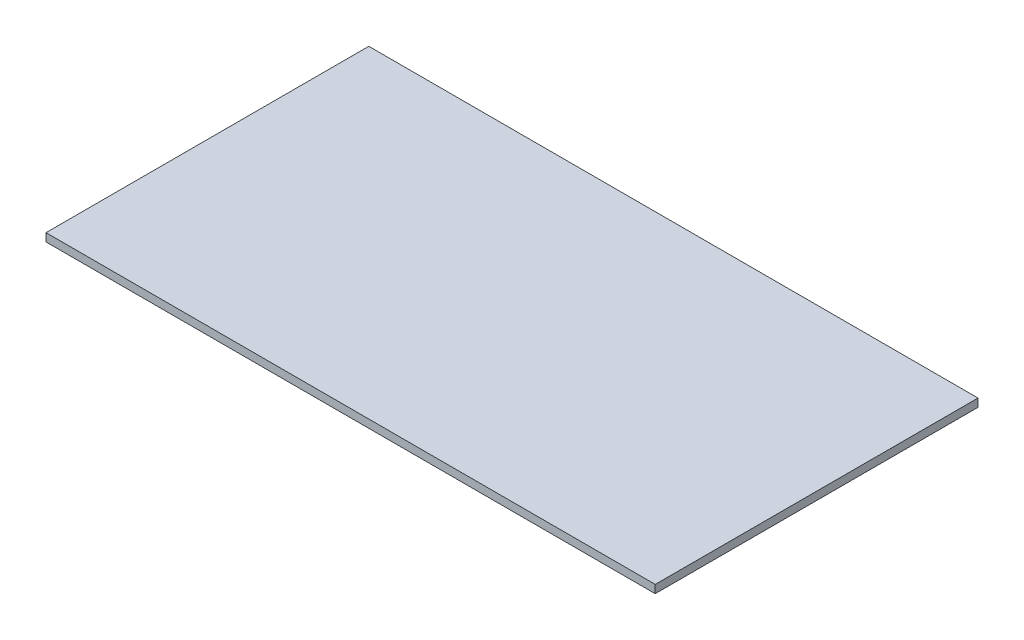
ISO-10303-21;
HEADER;
FILE_DESCRIPTION(('STEP AP214'),'2;1');
FILE_NAME('part.step','',(''),(''),'','','');
FILE_SCHEMA(('AUTOMOTIVE_DESIGN { 1 0 10303 214 1 1 1 1 }'));
ENDSEC;
DATA;
#1=APPLICATION_CONTEXT('core data for automotive mechanical design processes');
#2=APPLICATION_PROTOCOL_DEFINITION('international standard','automotive_design',2000,#1);
#3=PRODUCT_CONTEXT('',#1,'mechanical');
#4=PRODUCT('Part','Part','',(#3));
#5=PRODUCT_RELATED_PRODUCT_CATEGORY('part','',(#4));
#6=PRODUCT_DEFINITION_FORMATION('','',#4);
#7=PRODUCT_DEFINITION_CONTEXT('part definition',#1,'design');
#8=PRODUCT_DEFINITION('design','',#6,#7);
#9=PRODUCT_DEFINITION_SHAPE('','',#8);
#10=(LENGTH_UNIT() NAMED_UNIT(*) SI_UNIT(.MILLI.,.METRE.));
#11=(NAMED_UNIT(*) PLANE_ANGLE_UNIT() SI_UNIT($,.RADIAN.));
#12=(NAMED_UNIT(*) SI_UNIT($,.STERADIAN.) SOLID_ANGLE_UNIT());
#13=UNCERTAINTY_MEASURE_WITH_UNIT(LENGTH_MEASURE(1.E-05),#10,'distance_accuracy_value','');
#14=(GEOMETRIC_REPRESENTATION_CONTEXT(3) GLOBAL_UNCERTAINTY_ASSIGNED_CONTEXT((#13)) GLOBAL_UNIT_ASSIGNED_CONTEXT((#10,
#11,#12)) REPRESENTATION_CONTEXT('',''));
#15=CARTESIAN_POINT('',(0.,0.,0.));
#16=DIRECTION('',(0.,0.,1.));
#17=DIRECTION('',(1.,0.,0.));
#18=AXIS2_PLACEMENT_3D('',#15,#16,#17);
#19=CARTESIAN_POINT('',(0.,0.,80.));
#20=DIRECTION('',(0.,1.,0.));
#21=DIRECTION('',(0.,0.,1.));
#22=AXIS2_PLACEMENT_3D('',#19,#20,#21);
#23=PLANE('',#22);
#24=DIRECTION('',(1.,0.,0.));
#25=VECTOR('',#24,1.);
#26=CARTESIAN_POINT('',(0.,0.,80.));
#27=LINE('',#26,#25);
#28=CARTESIAN_POINT('',(2.,0.,80.));
#29=VERTEX_POINT('',#28);
#30=CARTESIAN_POINT('',(153.,0.,80.));
#31=VERTEX_POINT('',#30);
#32=EDGE_CURVE('E12',#29,#31,#27,.T.);
#33=ORIENTED_EDGE('',*,*,#32,.F.);
#34=DIRECTION('',(0.,0.,1.));
#35=VECTOR('',#34,1.);
#36=CARTESIAN_POINT('',(2.,0.,0.));
#37=LINE('',#36,#35);
#38=CARTESIAN_POINT('',(2.,0.,0.));
#39=VERTEX_POINT('',#38);
#40=EDGE_CURVE('E127',#39,#29,#37,.T.);
#41=ORIENTED_EDGE('',*,*,#40,.F.);
#42=DIRECTION('',(1.,0.,0.));
#43=VECTOR('',#42,1.);
#44=CARTESIAN_POINT('',(0.,0.,0.));
#45=LINE('',#44,#43);
#46=CARTESIAN_POINT('',(153.,0.,0.));
#47=VERTEX_POINT('',#46);
#48=EDGE_CURVE('E65',#39,#47,#45,.T.);
#49=ORIENTED_EDGE('',*,*,#48,.T.);
#50=DIRECTION('',(0.,0.,1.));
#51=VECTOR('',#50,1.);
#52=CARTESIAN_POINT('',(153.,0.,0.));
#53=LINE('',#52,#51);
#54=EDGE_CURVE('E99',#47,#31,#53,.T.);
#55=ORIENTED_EDGE('',*,*,#54,.T.);
#56=EDGE_LOOP('',(#33,#41,#49,#55));
#57=FACE_BOUND('',#56,.T.);
#58=ADVANCED_FACE('F62',(#57),#23,.F.);
#59=CARTESIAN_POINT('',(153.,2.,2.));
#60=DIRECTION('',(0.,1.,0.));
#61=DIRECTION('',(0.,0.,1.));
#62=AXIS2_PLACEMENT_3D('',#59,#60,#61);
#63=PLANE('',#62);
#64=DIRECTION('',(-1.,0.,0.));
#65=VECTOR('',#64,1.);
#66=CARTESIAN_POINT('',(153.,2.,80.));
#67=LINE('',#66,#65);
#68=CARTESIAN_POINT('',(153.,2.,80.));
#69=VERTEX_POINT('',#68);
#70=CARTESIAN_POINT('',(2.,2.,80.));
#71=VERTEX_POINT('',#70);
#72=EDGE_CURVE('E119',#69,#71,#67,.T.);
#73=ORIENTED_EDGE('',*,*,#72,.F.);
#74=DIRECTION('',(0.,0.,1.));
#75=VECTOR('',#74,1.);
#76=CARTESIAN_POINT('',(153.,2.,2.));
#77=LINE('',#76,#75);
#78=CARTESIAN_POINT('',(153.,2.,0.));
#79=VERTEX_POINT('',#78);
#80=EDGE_CURVE('E79',#79,#69,#77,.T.);
#81=ORIENTED_EDGE('',*,*,#80,.F.);
#82=DIRECTION('',(-1.,0.,0.));
#83=VECTOR('',#82,1.);
#84=CARTESIAN_POINT('',(0.,2.,0.));
#85=LINE('',#84,#83);
#86=CARTESIAN_POINT('',(2.,2.,0.));
#87=VERTEX_POINT('',#86);
#88=EDGE_CURVE('E133',#79,#87,#85,.T.);
#89=ORIENTED_EDGE('',*,*,#88,.T.);
#90=DIRECTION('',(0.,0.,1.));
#91=VECTOR('',#90,1.);
#92=CARTESIAN_POINT('',(2.,2.,2.));
#93=LINE('',#92,#91);
#94=EDGE_CURVE('E138',#87,#71,#93,.T.);
#95=ORIENTED_EDGE('',*,*,#94,.T.);
#96=EDGE_LOOP('',(#73,#81,#89,#95));
#97=FACE_BOUND('',#96,.T.);
#98=ADVANCED_FACE('F142',(#97),#63,.T.);
#99=CARTESIAN_POINT('',(0.,0.,80.));
#100=DIRECTION('',(0.,0.,1.));
#101=DIRECTION('',(1.,0.,0.));
#102=AXIS2_PLACEMENT_3D('',#99,#100,#101);
#103=PLANE('',#102);
#104=DIRECTION('',(0.,1.,0.));
#105=VECTOR('',#104,1.);
#106=CARTESIAN_POINT('',(2.,0.,80.));
#107=LINE('',#106,#105);
#108=EDGE_CURVE('E115',#29,#71,#107,.T.);
#109=ORIENTED_EDGE('',*,*,#108,.F.);
#110=ORIENTED_EDGE('',*,*,#32,.T.);
#111=DIRECTION('',(0.,1.,0.));
#112=VECTOR('',#111,1.);
#113=CARTESIAN_POINT('',(153.,0.,80.));
#114=LINE('',#113,#112);
#115=EDGE_CURVE('E102',#31,#69,#114,.T.);
#116=ORIENTED_EDGE('',*,*,#115,.T.);
#117=ORIENTED_EDGE('',*,*,#72,.T.);
#118=EDGE_LOOP('',(#109,#110,#116,#117));
#119=FACE_BOUND('',#118,.T.);
#120=ADVANCED_FACE('F118',(#119),#103,.T.);
#121=CARTESIAN_POINT('',(0.,0.,0.));
#122=DIRECTION('',(0.,0.,1.));
#123=DIRECTION('',(1.,0.,0.));
#124=AXIS2_PLACEMENT_3D('',#121,#122,#123);
#125=PLANE('',#124);
#126=ORIENTED_EDGE('',*,*,#48,.F.);
#127=DIRECTION('',(0.,1.,0.));
#128=VECTOR('',#127,1.);
#129=CARTESIAN_POINT('',(2.,0.,0.));
#130=LINE('',#129,#128);
#131=EDGE_CURVE('E123',#39,#87,#130,.T.);
#132=ORIENTED_EDGE('',*,*,#131,.T.);
#133=ORIENTED_EDGE('',*,*,#88,.F.);
#134=DIRECTION('',(0.,1.,0.));
#135=VECTOR('',#134,1.);
#136=CARTESIAN_POINT('',(153.,0.,0.));
#137=LINE('',#136,#135);
#138=EDGE_CURVE('E107',#47,#79,#137,.T.);
#139=ORIENTED_EDGE('',*,*,#138,.F.);
#140=EDGE_LOOP('',(#126,#132,#133,#139));
#141=FACE_BOUND('',#140,.T.);
#142=ADVANCED_FACE('F146',(#141),#125,.F.);
#143=CARTESIAN_POINT('',(2.,0.,0.));
#144=DIRECTION('',(1.,0.,0.));
#145=DIRECTION('',(0.,0.,-1.));
#146=AXIS2_PLACEMENT_3D('',#143,#144,#145);
#147=PLANE('',#146);
#148=ORIENTED_EDGE('',*,*,#131,.F.);
#149=ORIENTED_EDGE('',*,*,#40,.T.);
#150=ORIENTED_EDGE('',*,*,#108,.T.);
#151=ORIENTED_EDGE('',*,*,#94,.F.);
#152=EDGE_LOOP('',(#148,#149,#150,#151));
#153=FACE_BOUND('',#152,.T.);
#154=ADVANCED_FACE('F144',(#153),#147,.F.);
#155=CARTESIAN_POINT('',(153.,0.,0.));
#156=DIRECTION('',(1.,0.,0.));
#157=DIRECTION('',(0.,0.,-1.));
#158=AXIS2_PLACEMENT_3D('',#155,#156,#157);
#159=PLANE('',#158);
#160=ORIENTED_EDGE('',*,*,#138,.T.);
#161=ORIENTED_EDGE('',*,*,#80,.T.);
#162=ORIENTED_EDGE('',*,*,#115,.F.);
#163=ORIENTED_EDGE('',*,*,#54,.F.);
#164=EDGE_LOOP('',(#160,#161,#162,#163));
#165=FACE_BOUND('',#164,.T.);
#166=ADVANCED_FACE('F103',(#165),#159,.T.);
#167=CLOSED_SHELL('',(#58,#98,#120,#142,#154,#166));
#168=MANIFOLD_SOLID_BREP('B2',#167);
#169=ADVANCED_BREP_SHAPE_REPRESENTATION('',(#18,#168),#14);
#170=SHAPE_DEFINITION_REPRESENTATION(#9,#169);
ENDSEC;
END-ISO-10303-21;
